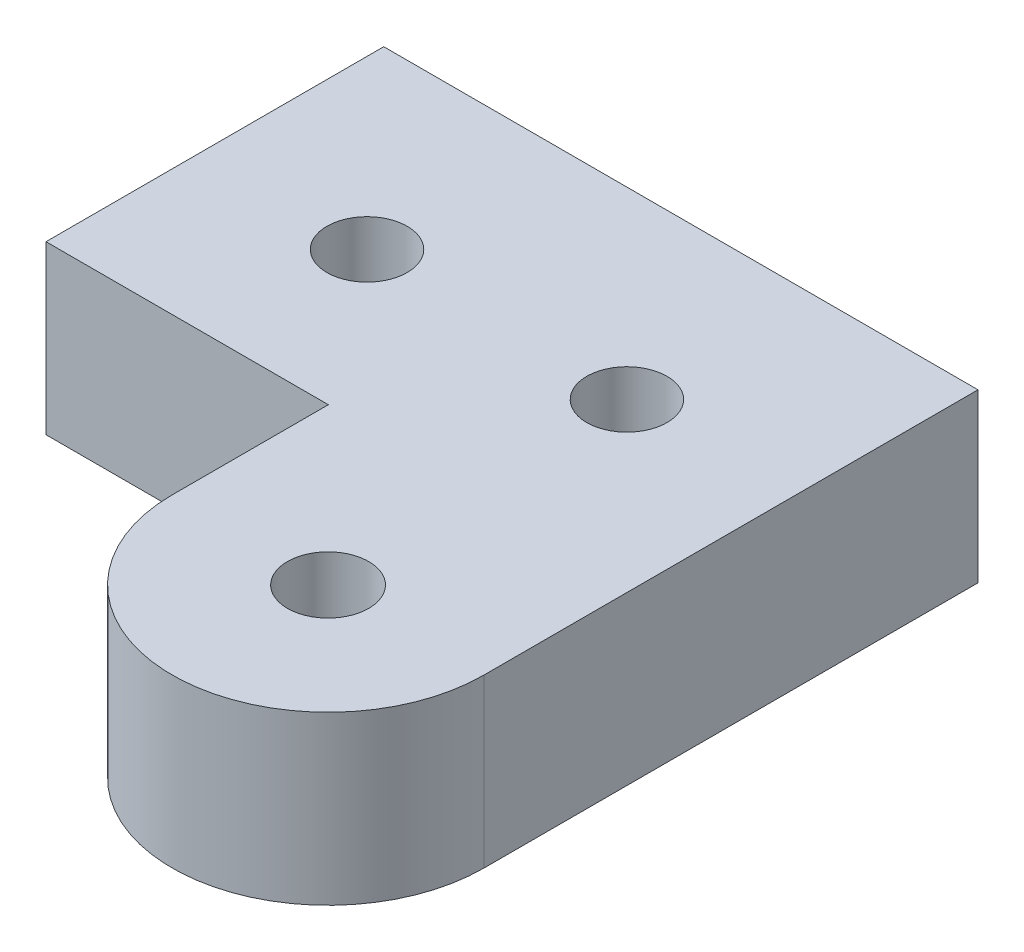
ISO-10303-21;
HEADER;
FILE_DESCRIPTION(('STEP AP214'),'2;1');
FILE_NAME('part.step','',(''),(''),'','','');
FILE_SCHEMA(('AUTOMOTIVE_DESIGN { 1 0 10303 214 1 1 1 1 }'));
ENDSEC;
DATA;
#1=APPLICATION_CONTEXT('core data for automotive mechanical design processes');
#2=APPLICATION_PROTOCOL_DEFINITION('international standard','automotive_design',2000,#1);
#3=PRODUCT_CONTEXT('',#1,'mechanical');
#4=PRODUCT('Part','Part','',(#3));
#5=PRODUCT_RELATED_PRODUCT_CATEGORY('part','',(#4));
#6=PRODUCT_DEFINITION_FORMATION('','',#4);
#7=PRODUCT_DEFINITION_CONTEXT('part definition',#1,'design');
#8=PRODUCT_DEFINITION('design','',#6,#7);
#9=PRODUCT_DEFINITION_SHAPE('','',#8);
#10=(LENGTH_UNIT() NAMED_UNIT(*) SI_UNIT(.MILLI.,.METRE.));
#11=(NAMED_UNIT(*) PLANE_ANGLE_UNIT() SI_UNIT($,.RADIAN.));
#12=(NAMED_UNIT(*) SI_UNIT($,.STERADIAN.) SOLID_ANGLE_UNIT());
#13=UNCERTAINTY_MEASURE_WITH_UNIT(LENGTH_MEASURE(1.E-05),#10,'distance_accuracy_value','');
#14=(GEOMETRIC_REPRESENTATION_CONTEXT(3) GLOBAL_UNCERTAINTY_ASSIGNED_CONTEXT((#13)) GLOBAL_UNIT_ASSIGNED_CONTEXT((#10,
#11,#12)) REPRESENTATION_CONTEXT('',''));
#15=CARTESIAN_POINT('',(0.,0.,0.));
#16=DIRECTION('',(0.,0.,1.));
#17=DIRECTION('',(1.,0.,0.));
#18=AXIS2_PLACEMENT_3D('',#15,#16,#17);
#19=CARTESIAN_POINT('',(-12.8127456485174,5.,16.2781018875809));
#20=DIRECTION('',(1.,0.,0.));
#21=DIRECTION('',(0.,0.,-1.));
#22=AXIS2_PLACEMENT_3D('',#19,#20,#21);
#23=PLANE('',#22);
#24=DIRECTION('',(0.,0.,1.));
#25=VECTOR('',#24,1.);
#26=CARTESIAN_POINT('',(-12.8127456485174,0.,16.2781018875809));
#27=LINE('',#26,#25);
#28=CARTESIAN_POINT('',(-12.8127456485174,0.,13.5050878231695));
#29=VERTEX_POINT('',#28);
#30=CARTESIAN_POINT('',(-12.8127456485174,0.,23.6056351878773));
#31=VERTEX_POINT('',#30);
#32=EDGE_CURVE('E80',#29,#31,#27,.T.);
#33=ORIENTED_EDGE('',*,*,#32,.T.);
#34=DIRECTION('',(0.,-1.,0.));
#35=VECTOR('',#34,1.);
#36=CARTESIAN_POINT('',(-12.8127456485174,5.,23.6056351878773));
#37=LINE('',#36,#35);
#38=CARTESIAN_POINT('',(-12.8127456485174,5.,23.6056351878773));
#39=VERTEX_POINT('',#38);
#40=EDGE_CURVE('E11',#39,#31,#37,.T.);
#41=ORIENTED_EDGE('',*,*,#40,.F.);
#42=DIRECTION('',(0.,0.,1.));
#43=VECTOR('',#42,1.);
#44=CARTESIAN_POINT('',(-12.8127456485174,5.,13.5050878231695));
#45=LINE('',#44,#43);
#46=CARTESIAN_POINT('',(-12.8127456485174,5.,13.5050878231695));
#47=VERTEX_POINT('',#46);
#48=EDGE_CURVE('E86',#47,#39,#45,.T.);
#49=ORIENTED_EDGE('',*,*,#48,.F.);
#50=DIRECTION('',(0.,-1.,0.));
#51=VECTOR('',#50,1.);
#52=CARTESIAN_POINT('',(-12.8127456485174,5.,13.5050878231695));
#53=LINE('',#52,#51);
#54=EDGE_CURVE('E115',#47,#29,#53,.T.);
#55=ORIENTED_EDGE('',*,*,#54,.T.);
#56=EDGE_LOOP('',(#33,#41,#49,#55));
#57=FACE_BOUND('',#56,.T.);
#58=ADVANCED_FACE('F33',(#57),#23,.F.);
#59=CARTESIAN_POINT('',(-12.8127456485174,5.,23.6056351878773));
#60=DIRECTION('',(0.,0.,-1.));
#61=DIRECTION('',(-1.,0.,0.));
#62=AXIS2_PLACEMENT_3D('',#59,#60,#61);
#63=PLANE('',#62);
#64=DIRECTION('',(1.,0.,0.));
#65=VECTOR('',#64,1.);
#66=CARTESIAN_POINT('',(-12.8127456485174,0.,23.6056351878773));
#67=LINE('',#66,#65);
#68=CARTESIAN_POINT('',(-4.36852332631598,0.,23.6056351878773));
#69=VERTEX_POINT('',#68);
#70=EDGE_CURVE('E120',#31,#69,#67,.T.);
#71=ORIENTED_EDGE('',*,*,#70,.T.);
#72=DIRECTION('',(0.,-1.,0.));
#73=VECTOR('',#72,1.);
#74=CARTESIAN_POINT('',(-4.36852332631598,5.,23.6056351878773));
#75=LINE('',#74,#73);
#76=CARTESIAN_POINT('',(-4.36852332631598,5.,23.6056351878773));
#77=VERTEX_POINT('',#76);
#78=EDGE_CURVE('E42',#77,#69,#75,.T.);
#79=ORIENTED_EDGE('',*,*,#78,.F.);
#80=DIRECTION('',(1.,0.,0.));
#81=VECTOR('',#80,1.);
#82=CARTESIAN_POINT('',(-12.8127456485174,5.,23.6056351878773));
#83=LINE('',#82,#81);
#84=EDGE_CURVE('E153',#39,#77,#83,.T.);
#85=ORIENTED_EDGE('',*,*,#84,.F.);
#86=ORIENTED_EDGE('',*,*,#40,.T.);
#87=EDGE_LOOP('',(#71,#79,#85,#86));
#88=FACE_BOUND('',#87,.T.);
#89=ADVANCED_FACE('F157',(#88),#63,.F.);
#90=CARTESIAN_POINT('',(-4.36852332631598,5.,28.2781018875809));
#91=DIRECTION('',(1.,0.,0.));
#92=DIRECTION('',(0.,0.,-1.));
#93=AXIS2_PLACEMENT_3D('',#90,#91,#92);
#94=PLANE('',#93);
#95=DIRECTION('',(0.,0.,1.));
#96=VECTOR('',#95,1.);
#97=CARTESIAN_POINT('',(-4.36852332631598,0.,28.2781018875809));
#98=LINE('',#97,#96);
#99=CARTESIAN_POINT('',(-4.36852332631598,0.,28.2781018875809));
#100=VERTEX_POINT('',#99);
#101=EDGE_CURVE('E123',#69,#100,#98,.T.);
#102=ORIENTED_EDGE('',*,*,#101,.T.);
#103=DIRECTION('',(0.,-1.,0.));
#104=VECTOR('',#103,1.);
#105=CARTESIAN_POINT('',(-4.36852332631598,5.,28.2781018875809));
#106=LINE('',#105,#104);
#107=CARTESIAN_POINT('',(-4.36852332631598,5.,28.2781018875809));
#108=VERTEX_POINT('',#107);
#109=EDGE_CURVE('E110',#108,#100,#106,.T.);
#110=ORIENTED_EDGE('',*,*,#109,.F.);
#111=DIRECTION('',(0.,0.,1.));
#112=VECTOR('',#111,1.);
#113=CARTESIAN_POINT('',(-4.36852332631598,5.,28.2781018875809));
#114=LINE('',#113,#112);
#115=EDGE_CURVE('E100',#77,#108,#114,.T.);
#116=ORIENTED_EDGE('',*,*,#115,.F.);
#117=ORIENTED_EDGE('',*,*,#78,.T.);
#118=EDGE_LOOP('',(#102,#110,#116,#117));
#119=FACE_BOUND('',#118,.T.);
#120=ADVANCED_FACE('F160',(#119),#94,.F.);
#121=CARTESIAN_POINT('',(0.29516669209581,5.,28.2781018875809));
#122=DIRECTION('',(0.,-1.,0.));
#123=DIRECTION('',(0.,0.,-1.));
#124=AXIS2_PLACEMENT_3D('',#121,#122,#123);
#125=CYLINDRICAL_SURFACE('',#124,4.66369001841179);
#126=CARTESIAN_POINT('',(0.29516669209581,0.,28.2781018875809));
#127=DIRECTION('',(0.,1.,0.));
#128=DIRECTION('',(0.,0.,1.));
#129=AXIS2_PLACEMENT_3D('',#126,#127,#128);
#130=CIRCLE('',#129,4.66369001841179);
#131=CARTESIAN_POINT('',(4.9588567105076,0.,28.2781018875809));
#132=VERTEX_POINT('',#131);
#133=EDGE_CURVE('E109',#100,#132,#130,.T.);
#134=ORIENTED_EDGE('',*,*,#133,.T.);
#135=DIRECTION('',(0.,-1.,0.));
#136=VECTOR('',#135,1.);
#137=CARTESIAN_POINT('',(4.9588567105076,5.,28.2781018875809));
#138=LINE('',#137,#136);
#139=CARTESIAN_POINT('',(4.9588567105076,5.,28.2781018875809));
#140=VERTEX_POINT('',#139);
#141=EDGE_CURVE('E106',#140,#132,#138,.T.);
#142=ORIENTED_EDGE('',*,*,#141,.F.);
#143=CARTESIAN_POINT('',(0.29516669209581,5.,28.2781018875809));
#144=DIRECTION('',(0.,1.,0.));
#145=DIRECTION('',(0.,0.,1.));
#146=AXIS2_PLACEMENT_3D('',#143,#144,#145);
#147=CIRCLE('',#146,4.66369001841179);
#148=EDGE_CURVE('E94',#108,#140,#147,.T.);
#149=ORIENTED_EDGE('',*,*,#148,.F.);
#150=ORIENTED_EDGE('',*,*,#109,.T.);
#151=EDGE_LOOP('',(#134,#142,#149,#150));
#152=FACE_BOUND('',#151,.T.);
#153=ADVANCED_FACE('F107',(#152),#125,.T.);
#154=CARTESIAN_POINT('',(4.9588567105076,5.,16.2781018875809));
#155=DIRECTION('',(-1.,0.,0.));
#156=DIRECTION('',(0.,0.,1.));
#157=AXIS2_PLACEMENT_3D('',#154,#155,#156);
#158=PLANE('',#157);
#159=DIRECTION('',(0.,0.,-1.));
#160=VECTOR('',#159,1.);
#161=CARTESIAN_POINT('',(4.9588567105076,0.,16.2781018875809));
#162=LINE('',#161,#160);
#163=CARTESIAN_POINT('',(4.9588567105076,0.,13.5050878231695));
#164=VERTEX_POINT('',#163);
#165=EDGE_CURVE('E73',#132,#164,#162,.T.);
#166=ORIENTED_EDGE('',*,*,#165,.T.);
#167=DIRECTION('',(0.,-1.,0.));
#168=VECTOR('',#167,1.);
#169=CARTESIAN_POINT('',(4.9588567105076,5.,13.5050878231695));
#170=LINE('',#169,#168);
#171=CARTESIAN_POINT('',(4.9588567105076,5.,13.5050878231695));
#172=VERTEX_POINT('',#171);
#173=EDGE_CURVE('E111',#172,#164,#170,.T.);
#174=ORIENTED_EDGE('',*,*,#173,.F.);
#175=DIRECTION('',(0.,0.,-1.));
#176=VECTOR('',#175,1.);
#177=CARTESIAN_POINT('',(4.9588567105076,5.,28.2781018875809));
#178=LINE('',#177,#176);
#179=EDGE_CURVE('E98',#140,#172,#178,.T.);
#180=ORIENTED_EDGE('',*,*,#179,.F.);
#181=ORIENTED_EDGE('',*,*,#141,.T.);
#182=EDGE_LOOP('',(#166,#174,#180,#181));
#183=FACE_BOUND('',#182,.T.);
#184=ADVANCED_FACE('F113',(#183),#158,.F.);
#185=CARTESIAN_POINT('',(4.9588567105076,5.,13.5050878231695));
#186=DIRECTION('',(0.,0.,1.));
#187=DIRECTION('',(1.,0.,0.));
#188=AXIS2_PLACEMENT_3D('',#185,#186,#187);
#189=PLANE('',#188);
#190=DIRECTION('',(-1.,0.,0.));
#191=VECTOR('',#190,1.);
#192=CARTESIAN_POINT('',(4.9588567105076,0.,13.5050878231695));
#193=LINE('',#192,#191);
#194=EDGE_CURVE('E127',#164,#29,#193,.T.);
#195=ORIENTED_EDGE('',*,*,#194,.T.);
#196=ORIENTED_EDGE('',*,*,#54,.F.);
#197=DIRECTION('',(-1.,0.,0.));
#198=VECTOR('',#197,1.);
#199=CARTESIAN_POINT('',(4.9588567105076,5.,13.5050878231695));
#200=LINE('',#199,#198);
#201=EDGE_CURVE('E51',#172,#47,#200,.T.);
#202=ORIENTED_EDGE('',*,*,#201,.F.);
#203=ORIENTED_EDGE('',*,*,#173,.T.);
#204=EDGE_LOOP('',(#195,#196,#202,#203));
#205=FACE_BOUND('',#204,.T.);
#206=ADVANCED_FACE('F163',(#205),#189,.F.);
#207=CARTESIAN_POINT('',(0.29516669209581,5.,28.2781018875809));
#208=DIRECTION('',(0.,1.,0.));
#209=DIRECTION('',(0.,0.,1.));
#210=AXIS2_PLACEMENT_3D('',#207,#208,#209);
#211=PLANE('',#210);
#212=CARTESIAN_POINT('',(0.29516669209581,5.,28.2781018875809));
#213=DIRECTION('',(0.,1.,0.));
#214=DIRECTION('',(0.,0.,1.));
#215=AXIS2_PLACEMENT_3D('',#212,#213,#214);
#216=CIRCLE('',#215,1.215);
#217=CARTESIAN_POINT('',(0.29516669209581,5.,29.4931018875809));
#218=VERTEX_POINT('',#217);
#219=EDGE_CURVE('E147',#218,#218,#216,.T.);
#220=ORIENTED_EDGE('',*,*,#219,.F.);
#221=EDGE_LOOP('',(#220));
#222=FACE_BOUND('',#221,.T.);
#223=CARTESIAN_POINT('',(-0.041143289492401,5.,19.0050878231695));
#224=DIRECTION('',(0.,1.,0.));
#225=DIRECTION('',(0.,0.,1.));
#226=AXIS2_PLACEMENT_3D('',#223,#224,#225);
#227=CIRCLE('',#226,1.2);
#228=CARTESIAN_POINT('',(-0.041143289492401,5.,20.2050878231695));
#229=VERTEX_POINT('',#228);
#230=EDGE_CURVE('E137',#229,#229,#227,.T.);
#231=ORIENTED_EDGE('',*,*,#230,.F.);
#232=EDGE_LOOP('',(#231));
#233=FACE_BOUND('',#232,.T.);
#234=CARTESIAN_POINT('',(-7.81274564851742,5.,19.0050878231695));
#235=DIRECTION('',(0.,1.,0.));
#236=DIRECTION('',(0.,0.,1.));
#237=AXIS2_PLACEMENT_3D('',#234,#235,#236);
#238=CIRCLE('',#237,1.2);
#239=CARTESIAN_POINT('',(-7.81274564851742,5.,20.2050878231695));
#240=VERTEX_POINT('',#239);
#241=EDGE_CURVE('E136',#240,#240,#238,.T.);
#242=ORIENTED_EDGE('',*,*,#241,.F.);
#243=EDGE_LOOP('',(#242));
#244=FACE_BOUND('',#243,.T.);
#245=ORIENTED_EDGE('',*,*,#48,.T.);
#246=ORIENTED_EDGE('',*,*,#84,.T.);
#247=ORIENTED_EDGE('',*,*,#115,.T.);
#248=ORIENTED_EDGE('',*,*,#148,.T.);
#249=ORIENTED_EDGE('',*,*,#179,.T.);
#250=ORIENTED_EDGE('',*,*,#201,.T.);
#251=EDGE_LOOP('',(#245,#246,#247,#248,#249,#250));
#252=FACE_BOUND('',#251,.T.);
#253=ADVANCED_FACE('F96',(#222,#233,#244,#252),#211,.T.);
#254=CARTESIAN_POINT('',(0.29516669209581,0.,28.2781018875809));
#255=DIRECTION('',(0.,1.,0.));
#256=DIRECTION('',(0.,0.,1.));
#257=AXIS2_PLACEMENT_3D('',#254,#255,#256);
#258=PLANE('',#257);
#259=CARTESIAN_POINT('',(0.29516669209581,0.,28.2781018875809));
#260=DIRECTION('',(0.,1.,0.));
#261=DIRECTION('',(0.,0.,1.));
#262=AXIS2_PLACEMENT_3D('',#259,#260,#261);
#263=CIRCLE('',#262,1.215);
#264=CARTESIAN_POINT('',(0.29516669209581,0.,29.4931018875809));
#265=VERTEX_POINT('',#264);
#266=EDGE_CURVE('E36',#265,#265,#263,.T.);
#267=ORIENTED_EDGE('',*,*,#266,.T.);
#268=EDGE_LOOP('',(#267));
#269=FACE_BOUND('',#268,.T.);
#270=CARTESIAN_POINT('',(-0.041143289492401,0.,19.0050878231695));
#271=DIRECTION('',(0.,1.,0.));
#272=DIRECTION('',(0.,0.,1.));
#273=AXIS2_PLACEMENT_3D('',#270,#271,#272);
#274=CIRCLE('',#273,1.2);
#275=CARTESIAN_POINT('',(-0.041143289492401,0.,20.2050878231695));
#276=VERTEX_POINT('',#275);
#277=EDGE_CURVE('E134',#276,#276,#274,.T.);
#278=ORIENTED_EDGE('',*,*,#277,.T.);
#279=EDGE_LOOP('',(#278));
#280=FACE_BOUND('',#279,.T.);
#281=CARTESIAN_POINT('',(-7.81274564851742,0.,19.0050878231695));
#282=DIRECTION('',(0.,1.,0.));
#283=DIRECTION('',(0.,0.,1.));
#284=AXIS2_PLACEMENT_3D('',#281,#282,#283);
#285=CIRCLE('',#284,1.2);
#286=CARTESIAN_POINT('',(-7.81274564851742,0.,20.2050878231695));
#287=VERTEX_POINT('',#286);
#288=EDGE_CURVE('E121',#287,#287,#285,.T.);
#289=ORIENTED_EDGE('',*,*,#288,.T.);
#290=EDGE_LOOP('',(#289));
#291=FACE_BOUND('',#290,.T.);
#292=ORIENTED_EDGE('',*,*,#32,.F.);
#293=ORIENTED_EDGE('',*,*,#194,.F.);
#294=ORIENTED_EDGE('',*,*,#165,.F.);
#295=ORIENTED_EDGE('',*,*,#133,.F.);
#296=ORIENTED_EDGE('',*,*,#101,.F.);
#297=ORIENTED_EDGE('',*,*,#70,.F.);
#298=EDGE_LOOP('',(#292,#293,#294,#295,#296,#297));
#299=FACE_BOUND('',#298,.T.);
#300=ADVANCED_FACE('F161',(#269,#280,#291,#299),#258,.F.);
#301=CARTESIAN_POINT('',(-7.81274564851742,5.,19.0050878231695));
#302=DIRECTION('',(0.,1.,0.));
#303=DIRECTION('',(0.,0.,1.));
#304=AXIS2_PLACEMENT_3D('',#301,#302,#303);
#305=CYLINDRICAL_SURFACE('',#304,1.2);
#306=ORIENTED_EDGE('',*,*,#241,.T.);
#307=EDGE_LOOP('',(#306));
#308=FACE_BOUND('',#307,.T.);
#309=ORIENTED_EDGE('',*,*,#288,.F.);
#310=EDGE_LOOP('',(#309));
#311=FACE_BOUND('',#310,.T.);
#312=ADVANCED_FACE('F182',(#308,#311),#305,.F.);
#313=CARTESIAN_POINT('',(-0.041143289492401,5.,19.0050878231695));
#314=DIRECTION('',(0.,1.,0.));
#315=DIRECTION('',(0.,0.,1.));
#316=AXIS2_PLACEMENT_3D('',#313,#314,#315);
#317=CYLINDRICAL_SURFACE('',#316,1.2);
#318=ORIENTED_EDGE('',*,*,#230,.T.);
#319=EDGE_LOOP('',(#318));
#320=FACE_BOUND('',#319,.T.);
#321=ORIENTED_EDGE('',*,*,#277,.F.);
#322=EDGE_LOOP('',(#321));
#323=FACE_BOUND('',#322,.T.);
#324=ADVANCED_FACE('F189',(#320,#323),#317,.F.);
#325=CARTESIAN_POINT('',(0.29516669209581,-5.,28.2781018875809));
#326=DIRECTION('',(0.,1.,0.));
#327=DIRECTION('',(0.,0.,1.));
#328=AXIS2_PLACEMENT_3D('',#325,#326,#327);
#329=CYLINDRICAL_SURFACE('',#328,1.215);
#330=ORIENTED_EDGE('',*,*,#219,.T.);
#331=EDGE_LOOP('',(#330));
#332=FACE_BOUND('',#331,.T.);
#333=ORIENTED_EDGE('',*,*,#266,.F.);
#334=EDGE_LOOP('',(#333));
#335=FACE_BOUND('',#334,.T.);
#336=ADVANCED_FACE('F193',(#332,#335),#329,.F.);
#337=CLOSED_SHELL('',(#58,#89,#120,#153,#184,#206,#253,#300,#312,#324,#336));
#338=MANIFOLD_SOLID_BREP('B2',#337);
#339=ADVANCED_BREP_SHAPE_REPRESENTATION('',(#18,#338),#14);
#340=SHAPE_DEFINITION_REPRESENTATION(#9,#339);
ENDSEC;
END-ISO-10303-21;
